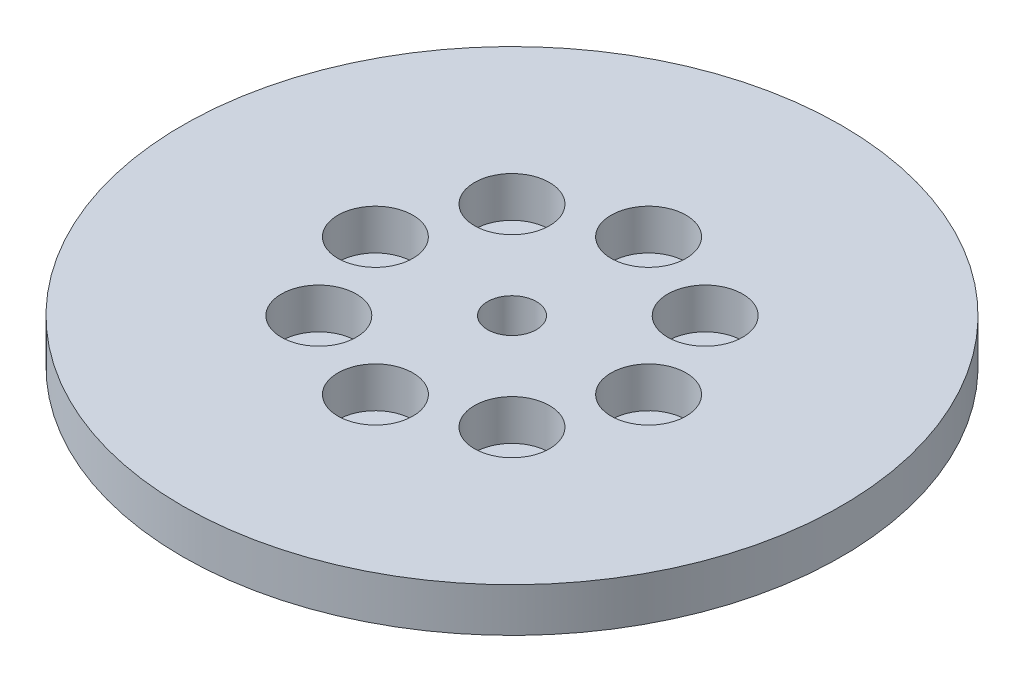
ISO-10303-21;
HEADER;
FILE_DESCRIPTION(('STEP AP214'),'2;1');
FILE_NAME('part.step','',(''),(''),'','','');
FILE_SCHEMA(('AUTOMOTIVE_DESIGN { 1 0 10303 214 1 1 1 1 }'));
ENDSEC;
DATA;
#1=APPLICATION_CONTEXT('core data for automotive mechanical design processes');
#2=APPLICATION_PROTOCOL_DEFINITION('international standard','automotive_design',2000,#1);
#3=PRODUCT_CONTEXT('',#1,'mechanical');
#4=PRODUCT('Part','Part','',(#3));
#5=PRODUCT_RELATED_PRODUCT_CATEGORY('part','',(#4));
#6=PRODUCT_DEFINITION_FORMATION('','',#4);
#7=PRODUCT_DEFINITION_CONTEXT('part definition',#1,'design');
#8=PRODUCT_DEFINITION('design','',#6,#7);
#9=PRODUCT_DEFINITION_SHAPE('','',#8);
#10=(LENGTH_UNIT() NAMED_UNIT(*) SI_UNIT(.MILLI.,.METRE.));
#11=(NAMED_UNIT(*) PLANE_ANGLE_UNIT() SI_UNIT($,.RADIAN.));
#12=(NAMED_UNIT(*) SI_UNIT($,.STERADIAN.) SOLID_ANGLE_UNIT());
#13=UNCERTAINTY_MEASURE_WITH_UNIT(LENGTH_MEASURE(1.E-05),#10,'distance_accuracy_value','');
#14=(GEOMETRIC_REPRESENTATION_CONTEXT(3) GLOBAL_UNCERTAINTY_ASSIGNED_CONTEXT((#13)) GLOBAL_UNIT_ASSIGNED_CONTEXT((#10,
#11,#12)) REPRESENTATION_CONTEXT('',''));
#15=CARTESIAN_POINT('',(0.,0.,0.));
#16=DIRECTION('',(0.,0.,1.));
#17=DIRECTION('',(1.,0.,0.));
#18=AXIS2_PLACEMENT_3D('',#15,#16,#17);
#19=CARTESIAN_POINT('',(0.,9.,0.));
#20=DIRECTION('',(0.,-1.,0.));
#21=DIRECTION('',(0.,0.,-1.));
#22=AXIS2_PLACEMENT_3D('',#19,#20,#21);
#23=CYLINDRICAL_SURFACE('',#22,67.5);
#24=CARTESIAN_POINT('',(0.,9.,0.));
#25=DIRECTION('',(0.,1.,0.));
#26=DIRECTION('',(0.,0.,1.));
#27=AXIS2_PLACEMENT_3D('',#24,#25,#26);
#28=CIRCLE('',#27,67.5);
#29=CARTESIAN_POINT('',(0.,9.,67.5));
#30=VERTEX_POINT('',#29);
#31=EDGE_CURVE('E10',#30,#30,#28,.T.);
#32=ORIENTED_EDGE('',*,*,#31,.F.);
#33=EDGE_LOOP('',(#32));
#34=FACE_BOUND('',#33,.T.);
#35=CARTESIAN_POINT('',(0.,0.,0.));
#36=DIRECTION('',(0.,1.,0.));
#37=DIRECTION('',(0.,0.,1.));
#38=AXIS2_PLACEMENT_3D('',#35,#36,#37);
#39=CIRCLE('',#38,67.5);
#40=CARTESIAN_POINT('',(0.,0.,67.5));
#41=VERTEX_POINT('',#40);
#42=EDGE_CURVE('E37',#41,#41,#39,.T.);
#43=ORIENTED_EDGE('',*,*,#42,.T.);
#44=EDGE_LOOP('',(#43));
#45=FACE_BOUND('',#44,.T.);
#46=ADVANCED_FACE('F40',(#34,#45),#23,.T.);
#47=CARTESIAN_POINT('',(0.,9.,0.));
#48=DIRECTION('',(0.,1.,0.));
#49=DIRECTION('',(0.,0.,1.));
#50=AXIS2_PLACEMENT_3D('',#47,#48,#49);
#51=PLANE('',#50);
#52=CARTESIAN_POINT('',(0.,9.,27.9777051505342));
#53=DIRECTION('',(0.,1.,0.));
#54=DIRECTION('',(1.,0.,0.));
#55=AXIS2_PLACEMENT_3D('',#52,#53,#54);
#56=CIRCLE('',#55,7.67761535986026);
#57=CARTESIAN_POINT('',(7.67761535986035,9.,27.9777051505342));
#58=VERTEX_POINT('',#57);
#59=EDGE_CURVE('E88',#58,#58,#56,.T.);
#60=ORIENTED_EDGE('',*,*,#59,.F.);
#61=EDGE_LOOP('',(#60));
#62=FACE_BOUND('',#61,.T.);
#63=CARTESIAN_POINT('',(19.7832250339806,9.,19.7832250339804));
#64=DIRECTION('',(0.,1.,0.));
#65=DIRECTION('',(0.707106781186544,0.,-0.707106781186551));
#66=AXIS2_PLACEMENT_3D('',#63,#64,#65);
#67=CIRCLE('',#66,7.67761535986026);
#68=CARTESIAN_POINT('',(25.2121189182798,9.,14.3543311496812));
#69=VERTEX_POINT('',#68);
#70=EDGE_CURVE('E79',#69,#69,#67,.T.);
#71=ORIENTED_EDGE('',*,*,#70,.F.);
#72=EDGE_LOOP('',(#71));
#73=FACE_BOUND('',#72,.T.);
#74=CARTESIAN_POINT('',(27.9777051505342,9.,0.));
#75=DIRECTION('',(0.,1.,0.));
#76=DIRECTION('',(0.,0.,-1.));
#77=AXIS2_PLACEMENT_3D('',#74,#75,#76);
#78=CIRCLE('',#77,7.67761535986026);
#79=CARTESIAN_POINT('',(27.9777051505342,9.,-7.67761535986026));
#80=VERTEX_POINT('',#79);
#81=EDGE_CURVE('E74',#80,#80,#78,.T.);
#82=ORIENTED_EDGE('',*,*,#81,.F.);
#83=EDGE_LOOP('',(#82));
#84=FACE_BOUND('',#83,.T.);
#85=CARTESIAN_POINT('',(19.7832250339804,9.,-19.7832250339807));
#86=DIRECTION('',(0.,1.,0.));
#87=DIRECTION('',(-0.707106781186554,0.,-0.707106781186541));
#88=AXIS2_PLACEMENT_3D('',#85,#86,#87);
#89=CIRCLE('',#88,7.67761535986026);
#90=CARTESIAN_POINT('',(14.3543311496811,9.,-25.2121189182798));
#91=VERTEX_POINT('',#90);
#92=EDGE_CURVE('E70',#91,#91,#89,.T.);
#93=ORIENTED_EDGE('',*,*,#92,.F.);
#94=EDGE_LOOP('',(#93));
#95=FACE_BOUND('',#94,.T.);
#96=CARTESIAN_POINT('',(-2.93050906310237E-13,9.,-27.9777051505342));
#97=DIRECTION('',(0.,1.,0.));
#98=DIRECTION('',(-1.,0.,0.));
#99=AXIS2_PLACEMENT_3D('',#96,#97,#98);
#100=CIRCLE('',#99,7.67761535986026);
#101=CARTESIAN_POINT('',(-7.67761535986055,9.,-27.9777051505341));
#102=VERTEX_POINT('',#101);
#103=EDGE_CURVE('E100',#102,#102,#100,.T.);
#104=ORIENTED_EDGE('',*,*,#103,.F.);
#105=EDGE_LOOP('',(#104));
#106=FACE_BOUND('',#105,.T.);
#107=CARTESIAN_POINT('',(-19.7832250339808,9.,-19.7832250339803));
#108=DIRECTION('',(0.,1.,0.));
#109=DIRECTION('',(-0.707106781186539,0.,0.707106781186556));
#110=AXIS2_PLACEMENT_3D('',#107,#108,#109);
#111=CIRCLE('',#110,7.67761535986026);
#112=CARTESIAN_POINT('',(-25.2121189182799,9.,-14.354331149681));
#113=VERTEX_POINT('',#112);
#114=EDGE_CURVE('E93',#113,#113,#111,.T.);
#115=ORIENTED_EDGE('',*,*,#114,.F.);
#116=EDGE_LOOP('',(#115));
#117=FACE_BOUND('',#116,.T.);
#118=CARTESIAN_POINT('',(-19.7832250339805,9.,19.7832250339806));
#119=DIRECTION('',(0.,1.,0.));
#120=DIRECTION('',(0.707106781186549,0.,0.707106781186546));
#121=AXIS2_PLACEMENT_3D('',#118,#119,#120);
#122=CIRCLE('',#121,7.67761535986026);
#123=CARTESIAN_POINT('',(-14.3543311496813,9.,25.2121189182797));
#124=VERTEX_POINT('',#123);
#125=EDGE_CURVE('E61',#124,#124,#122,.T.);
#126=ORIENTED_EDGE('',*,*,#125,.F.);
#127=EDGE_LOOP('',(#126));
#128=FACE_BOUND('',#127,.T.);
#129=CARTESIAN_POINT('',(-27.9777051505342,9.,0.));
#130=DIRECTION('',(0.,1.,0.));
#131=DIRECTION('',(0.,0.,1.));
#132=AXIS2_PLACEMENT_3D('',#129,#130,#131);
#133=CIRCLE('',#132,7.67761535986026);
#134=CARTESIAN_POINT('',(-27.9777051505342,9.,7.67761535986026));
#135=VERTEX_POINT('',#134);
#136=EDGE_CURVE('E54',#135,#135,#133,.T.);
#137=ORIENTED_EDGE('',*,*,#136,.F.);
#138=EDGE_LOOP('',(#137));
#139=FACE_BOUND('',#138,.T.);
#140=CARTESIAN_POINT('',(0.,9.,0.));
#141=DIRECTION('',(0.,1.,0.));
#142=DIRECTION('',(0.,0.,1.));
#143=AXIS2_PLACEMENT_3D('',#140,#141,#142);
#144=CIRCLE('',#143,5.);
#145=CARTESIAN_POINT('',(0.,9.,5.));
#146=VERTEX_POINT('',#145);
#147=EDGE_CURVE('E50',#146,#146,#144,.T.);
#148=ORIENTED_EDGE('',*,*,#147,.F.);
#149=EDGE_LOOP('',(#148));
#150=FACE_BOUND('',#149,.T.);
#151=ORIENTED_EDGE('',*,*,#31,.T.);
#152=EDGE_LOOP('',(#151));
#153=FACE_BOUND('',#152,.T.);
#154=ADVANCED_FACE('F115',(#62,#73,#84,#95,#106,#117,#128,#139,#150,#153),#51,.T.);
#155=CARTESIAN_POINT('',(0.,0.,0.));
#156=DIRECTION('',(0.,1.,0.));
#157=DIRECTION('',(0.,0.,1.));
#158=AXIS2_PLACEMENT_3D('',#155,#156,#157);
#159=PLANE('',#158);
#160=CARTESIAN_POINT('',(0.,0.,0.));
#161=DIRECTION('',(0.,1.,0.));
#162=DIRECTION('',(0.,0.,1.));
#163=AXIS2_PLACEMENT_3D('',#160,#161,#162);
#164=CIRCLE('',#163,5.);
#165=CARTESIAN_POINT('',(0.,0.,5.));
#166=VERTEX_POINT('',#165);
#167=EDGE_CURVE('E47',#166,#166,#164,.T.);
#168=ORIENTED_EDGE('',*,*,#167,.T.);
#169=EDGE_LOOP('',(#168));
#170=FACE_BOUND('',#169,.T.);
#171=ORIENTED_EDGE('',*,*,#42,.F.);
#172=EDGE_LOOP('',(#171));
#173=FACE_BOUND('',#172,.T.);
#174=ADVANCED_FACE('F113',(#170,#173),#159,.F.);
#175=CARTESIAN_POINT('',(0.,9.,0.));
#176=DIRECTION('',(0.,-1.,0.));
#177=DIRECTION('',(0.,0.,-1.));
#178=AXIS2_PLACEMENT_3D('',#175,#176,#177);
#179=CYLINDRICAL_SURFACE('',#178,5.);
#180=ORIENTED_EDGE('',*,*,#147,.T.);
#181=EDGE_LOOP('',(#180));
#182=FACE_BOUND('',#181,.T.);
#183=ORIENTED_EDGE('',*,*,#167,.F.);
#184=EDGE_LOOP('',(#183));
#185=FACE_BOUND('',#184,.T.);
#186=ADVANCED_FACE('F127',(#182,#185),#179,.F.);
#187=CARTESIAN_POINT('',(-27.9777051505342,0.694941644092896,0.));
#188=DIRECTION('',(0.,1.,0.));
#189=DIRECTION('',(0.,0.,1.));
#190=AXIS2_PLACEMENT_3D('',#187,#188,#189);
#191=CYLINDRICAL_SURFACE('',#190,7.67761535986026);
#192=CARTESIAN_POINT('',(-27.9777051505342,0.694941644092896,0.));
#193=DIRECTION('',(0.,1.,0.));
#194=DIRECTION('',(0.,0.,1.));
#195=AXIS2_PLACEMENT_3D('',#192,#193,#194);
#196=CIRCLE('',#195,7.67761535986026);
#197=CARTESIAN_POINT('',(-27.9777051505342,0.694941644092896,7.67761535986026));
#198=VERTEX_POINT('',#197);
#199=EDGE_CURVE('E55',#198,#198,#196,.T.);
#200=ORIENTED_EDGE('',*,*,#199,.F.);
#201=EDGE_LOOP('',(#200));
#202=FACE_BOUND('',#201,.T.);
#203=ORIENTED_EDGE('',*,*,#136,.T.);
#204=EDGE_LOOP('',(#203));
#205=FACE_BOUND('',#204,.T.);
#206=ADVANCED_FACE('F129',(#202,#205),#191,.F.);
#207=CARTESIAN_POINT('',(-27.9777051505342,0.694941644092896,0.));
#208=DIRECTION('',(0.,1.,0.));
#209=DIRECTION('',(0.,0.,1.));
#210=AXIS2_PLACEMENT_3D('',#207,#208,#209);
#211=PLANE('',#210);
#212=ORIENTED_EDGE('',*,*,#199,.T.);
#213=EDGE_LOOP('',(#212));
#214=FACE_BOUND('',#213,.T.);
#215=ADVANCED_FACE('F157',(#214),#211,.T.);
#216=CARTESIAN_POINT('',(-19.7832250339805,0.694941644092896,19.7832250339806));
#217=DIRECTION('',(0.,1.,0.));
#218=DIRECTION('',(0.,0.,1.));
#219=AXIS2_PLACEMENT_3D('',#216,#217,#218);
#220=CYLINDRICAL_SURFACE('',#219,7.67761535986026);
#221=CARTESIAN_POINT('',(-19.7832250339805,0.694941644092896,19.7832250339806));
#222=DIRECTION('',(0.,1.,0.));
#223=DIRECTION('',(0.707106781186549,0.,0.707106781186546));
#224=AXIS2_PLACEMENT_3D('',#221,#222,#223);
#225=CIRCLE('',#224,7.67761535986026);
#226=CARTESIAN_POINT('',(-14.3543311496813,0.694941644092896,25.2121189182797));
#227=VERTEX_POINT('',#226);
#228=EDGE_CURVE('E59',#227,#227,#225,.T.);
#229=ORIENTED_EDGE('',*,*,#228,.F.);
#230=EDGE_LOOP('',(#229));
#231=FACE_BOUND('',#230,.T.);
#232=ORIENTED_EDGE('',*,*,#125,.T.);
#233=EDGE_LOOP('',(#232));
#234=FACE_BOUND('',#233,.T.);
#235=ADVANCED_FACE('F170',(#231,#234),#220,.F.);
#236=CARTESIAN_POINT('',(-19.7832250339805,0.694941644092896,19.7832250339806));
#237=DIRECTION('',(0.,1.,0.));
#238=DIRECTION('',(0.707106781186549,0.,0.707106781186546));
#239=AXIS2_PLACEMENT_3D('',#236,#237,#238);
#240=PLANE('',#239);
#241=ORIENTED_EDGE('',*,*,#228,.T.);
#242=EDGE_LOOP('',(#241));
#243=FACE_BOUND('',#242,.T.);
#244=ADVANCED_FACE('F182',(#243),#240,.T.);
#245=CARTESIAN_POINT('',(-19.7832250339808,0.694941644092896,-19.7832250339803));
#246=DIRECTION('',(0.,1.,0.));
#247=DIRECTION('',(0.,0.,1.));
#248=AXIS2_PLACEMENT_3D('',#245,#246,#247);
#249=CYLINDRICAL_SURFACE('',#248,7.67761535986026);
#250=CARTESIAN_POINT('',(-19.7832250339808,0.694941644092896,-19.7832250339803));
#251=DIRECTION('',(0.,1.,0.));
#252=DIRECTION('',(-0.707106781186539,0.,0.707106781186556));
#253=AXIS2_PLACEMENT_3D('',#250,#251,#252);
#254=CIRCLE('',#253,7.67761535986026);
#255=CARTESIAN_POINT('',(-25.2121189182799,0.694941644092896,-14.354331149681));
#256=VERTEX_POINT('',#255);
#257=EDGE_CURVE('E94',#256,#256,#254,.T.);
#258=ORIENTED_EDGE('',*,*,#257,.F.);
#259=EDGE_LOOP('',(#258));
#260=FACE_BOUND('',#259,.T.);
#261=ORIENTED_EDGE('',*,*,#114,.T.);
#262=EDGE_LOOP('',(#261));
#263=FACE_BOUND('',#262,.T.);
#264=ADVANCED_FACE('F189',(#260,#263),#249,.F.);
#265=CARTESIAN_POINT('',(-19.7832250339808,0.694941644092896,-19.7832250339803));
#266=DIRECTION('',(0.,1.,0.));
#267=DIRECTION('',(-0.707106781186539,0.,0.707106781186556));
#268=AXIS2_PLACEMENT_3D('',#265,#266,#267);
#269=PLANE('',#268);
#270=ORIENTED_EDGE('',*,*,#257,.T.);
#271=EDGE_LOOP('',(#270));
#272=FACE_BOUND('',#271,.T.);
#273=ADVANCED_FACE('F107',(#272),#269,.T.);
#274=CARTESIAN_POINT('',(-2.93050906310237E-13,0.694941644092896,-27.9777051505342));
#275=DIRECTION('',(0.,1.,0.));
#276=DIRECTION('',(0.,0.,1.));
#277=AXIS2_PLACEMENT_3D('',#274,#275,#276);
#278=CYLINDRICAL_SURFACE('',#277,7.67761535986026);
#279=CARTESIAN_POINT('',(-2.93050906310237E-13,0.694941644092896,-27.9777051505342));
#280=DIRECTION('',(0.,1.,0.));
#281=DIRECTION('',(-1.,0.,0.));
#282=AXIS2_PLACEMENT_3D('',#279,#280,#281);
#283=CIRCLE('',#282,7.67761535986026);
#284=CARTESIAN_POINT('',(-7.67761535986055,0.694941644092896,-27.9777051505341));
#285=VERTEX_POINT('',#284);
#286=EDGE_CURVE('E72',#285,#285,#283,.T.);
#287=ORIENTED_EDGE('',*,*,#286,.F.);
#288=EDGE_LOOP('',(#287));
#289=FACE_BOUND('',#288,.T.);
#290=ORIENTED_EDGE('',*,*,#103,.T.);
#291=EDGE_LOOP('',(#290));
#292=FACE_BOUND('',#291,.T.);
#293=ADVANCED_FACE('F104',(#289,#292),#278,.F.);
#294=CARTESIAN_POINT('',(-2.93050906310237E-13,0.694941644092896,-27.9777051505342));
#295=DIRECTION('',(0.,1.,0.));
#296=DIRECTION('',(-1.,0.,0.));
#297=AXIS2_PLACEMENT_3D('',#294,#295,#296);
#298=PLANE('',#297);
#299=ORIENTED_EDGE('',*,*,#286,.T.);
#300=EDGE_LOOP('',(#299));
#301=FACE_BOUND('',#300,.T.);
#302=ADVANCED_FACE('F103',(#301),#298,.T.);
#303=CARTESIAN_POINT('',(19.7832250339804,0.694941644092896,-19.7832250339807));
#304=DIRECTION('',(0.,1.,0.));
#305=DIRECTION('',(0.,0.,1.));
#306=AXIS2_PLACEMENT_3D('',#303,#304,#305);
#307=CYLINDRICAL_SURFACE('',#306,7.67761535986026);
#308=CARTESIAN_POINT('',(19.7832250339804,0.694941644092896,-19.7832250339807));
#309=DIRECTION('',(0.,1.,0.));
#310=DIRECTION('',(-0.707106781186554,0.,-0.707106781186541));
#311=AXIS2_PLACEMENT_3D('',#308,#309,#310);
#312=CIRCLE('',#311,7.67761535986026);
#313=CARTESIAN_POINT('',(14.3543311496811,0.694941644092896,-25.2121189182798));
#314=VERTEX_POINT('',#313);
#315=EDGE_CURVE('E69',#314,#314,#312,.T.);
#316=ORIENTED_EDGE('',*,*,#315,.F.);
#317=EDGE_LOOP('',(#316));
#318=FACE_BOUND('',#317,.T.);
#319=ORIENTED_EDGE('',*,*,#92,.T.);
#320=EDGE_LOOP('',(#319));
#321=FACE_BOUND('',#320,.T.);
#322=ADVANCED_FACE('F219',(#318,#321),#307,.F.);
#323=CARTESIAN_POINT('',(19.7832250339804,0.694941644092896,-19.7832250339807));
#324=DIRECTION('',(0.,1.,0.));
#325=DIRECTION('',(-0.707106781186554,0.,-0.707106781186541));
#326=AXIS2_PLACEMENT_3D('',#323,#324,#325);
#327=PLANE('',#326);
#328=ORIENTED_EDGE('',*,*,#315,.T.);
#329=EDGE_LOOP('',(#328));
#330=FACE_BOUND('',#329,.T.);
#331=ADVANCED_FACE('F227',(#330),#327,.T.);
#332=CARTESIAN_POINT('',(27.9777051505342,0.694941644092896,0.));
#333=DIRECTION('',(0.,1.,0.));
#334=DIRECTION('',(0.,0.,1.));
#335=AXIS2_PLACEMENT_3D('',#332,#333,#334);
#336=CYLINDRICAL_SURFACE('',#335,7.67761535986026);
#337=CARTESIAN_POINT('',(27.9777051505342,0.694941644092896,0.));
#338=DIRECTION('',(0.,1.,0.));
#339=DIRECTION('',(0.,0.,-1.));
#340=AXIS2_PLACEMENT_3D('',#337,#338,#339);
#341=CIRCLE('',#340,7.67761535986026);
#342=CARTESIAN_POINT('',(27.9777051505342,0.694941644092896,-7.67761535986026));
#343=VERTEX_POINT('',#342);
#344=EDGE_CURVE('E80',#343,#343,#341,.T.);
#345=ORIENTED_EDGE('',*,*,#344,.F.);
#346=EDGE_LOOP('',(#345));
#347=FACE_BOUND('',#346,.T.);
#348=ORIENTED_EDGE('',*,*,#81,.T.);
#349=EDGE_LOOP('',(#348));
#350=FACE_BOUND('',#349,.T.);
#351=ADVANCED_FACE('F240',(#347,#350),#336,.F.);
#352=CARTESIAN_POINT('',(27.9777051505342,0.694941644092896,0.));
#353=DIRECTION('',(0.,1.,0.));
#354=DIRECTION('',(0.,0.,-1.));
#355=AXIS2_PLACEMENT_3D('',#352,#353,#354);
#356=PLANE('',#355);
#357=ORIENTED_EDGE('',*,*,#344,.T.);
#358=EDGE_LOOP('',(#357));
#359=FACE_BOUND('',#358,.T.);
#360=ADVANCED_FACE('F246',(#359),#356,.T.);
#361=CARTESIAN_POINT('',(19.7832250339806,0.694941644092896,19.7832250339804));
#362=DIRECTION('',(0.,1.,0.));
#363=DIRECTION('',(0.,0.,1.));
#364=AXIS2_PLACEMENT_3D('',#361,#362,#363);
#365=CYLINDRICAL_SURFACE('',#364,7.67761535986026);
#366=CARTESIAN_POINT('',(19.7832250339806,0.694941644092896,19.7832250339804));
#367=DIRECTION('',(0.,1.,0.));
#368=DIRECTION('',(0.707106781186544,0.,-0.707106781186551));
#369=AXIS2_PLACEMENT_3D('',#366,#367,#368);
#370=CIRCLE('',#369,7.67761535986026);
#371=CARTESIAN_POINT('',(25.2121189182798,0.694941644092896,14.3543311496812));
#372=VERTEX_POINT('',#371);
#373=EDGE_CURVE('E82',#372,#372,#370,.T.);
#374=ORIENTED_EDGE('',*,*,#373,.F.);
#375=EDGE_LOOP('',(#374));
#376=FACE_BOUND('',#375,.T.);
#377=ORIENTED_EDGE('',*,*,#70,.T.);
#378=EDGE_LOOP('',(#377));
#379=FACE_BOUND('',#378,.T.);
#380=ADVANCED_FACE('F254',(#376,#379),#365,.F.);
#381=CARTESIAN_POINT('',(19.7832250339806,0.694941644092896,19.7832250339804));
#382=DIRECTION('',(0.,1.,0.));
#383=DIRECTION('',(0.707106781186544,0.,-0.707106781186551));
#384=AXIS2_PLACEMENT_3D('',#381,#382,#383);
#385=PLANE('',#384);
#386=ORIENTED_EDGE('',*,*,#373,.T.);
#387=EDGE_LOOP('',(#386));
#388=FACE_BOUND('',#387,.T.);
#389=ADVANCED_FACE('F262',(#388),#385,.T.);
#390=CARTESIAN_POINT('',(0.,0.694941644092896,27.9777051505342));
#391=DIRECTION('',(0.,1.,0.));
#392=DIRECTION('',(0.,0.,1.));
#393=AXIS2_PLACEMENT_3D('',#390,#391,#392);
#394=CYLINDRICAL_SURFACE('',#393,7.67761535986026);
#395=CARTESIAN_POINT('',(0.,0.694941644092896,27.9777051505342));
#396=DIRECTION('',(0.,1.,0.));
#397=DIRECTION('',(1.,0.,0.));
#398=AXIS2_PLACEMENT_3D('',#395,#396,#397);
#399=CIRCLE('',#398,7.67761535986026);
#400=CARTESIAN_POINT('',(7.67761535986035,0.694941644092896,27.9777051505342));
#401=VERTEX_POINT('',#400);
#402=EDGE_CURVE('E63',#401,#401,#399,.T.);
#403=ORIENTED_EDGE('',*,*,#402,.F.);
#404=EDGE_LOOP('',(#403));
#405=FACE_BOUND('',#404,.T.);
#406=ORIENTED_EDGE('',*,*,#59,.T.);
#407=EDGE_LOOP('',(#406));
#408=FACE_BOUND('',#407,.T.);
#409=ADVANCED_FACE('F272',(#405,#408),#394,.F.);
#410=CARTESIAN_POINT('',(0.,0.694941644092896,27.9777051505342));
#411=DIRECTION('',(0.,1.,0.));
#412=DIRECTION('',(1.,0.,0.));
#413=AXIS2_PLACEMENT_3D('',#410,#411,#412);
#414=PLANE('',#413);
#415=ORIENTED_EDGE('',*,*,#402,.T.);
#416=EDGE_LOOP('',(#415));
#417=FACE_BOUND('',#416,.T.);
#418=ADVANCED_FACE('F285',(#417),#414,.T.);
#419=CLOSED_SHELL('',(#46,#154,#174,#186,#206,#215,#235,#244,#264,#273,#293,#302,#322,#331,#351,
#360,#380,#389,#409,#418));
#420=MANIFOLD_SOLID_BREP('B2',#419);
#421=ADVANCED_BREP_SHAPE_REPRESENTATION('',(#18,#420),#14);
#422=SHAPE_DEFINITION_REPRESENTATION(#9,#421);
ENDSEC;
END-ISO-10303-21;
